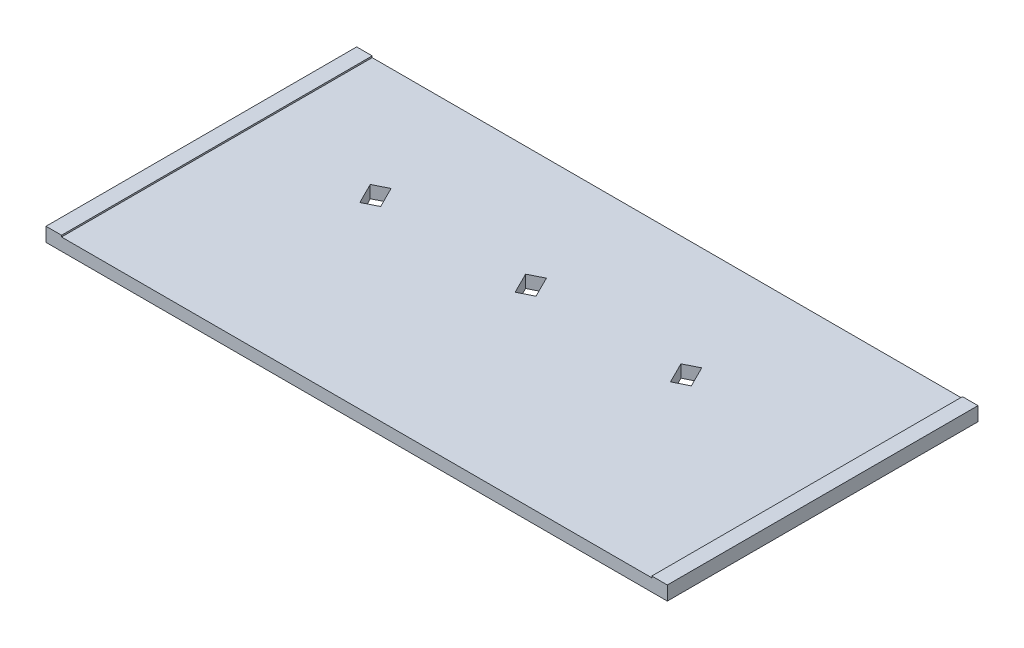
ISO-10303-21;
HEADER;
FILE_DESCRIPTION(('STEP AP214'),'2;1');
FILE_NAME('part.step','',(''),(''),'','','');
FILE_SCHEMA(('AUTOMOTIVE_DESIGN { 1 0 10303 214 1 1 1 1 }'));
ENDSEC;
DATA;
#1=APPLICATION_CONTEXT('core data for automotive mechanical design processes');
#2=APPLICATION_PROTOCOL_DEFINITION('international standard','automotive_design',2000,#1);
#3=PRODUCT_CONTEXT('',#1,'mechanical');
#4=PRODUCT('Part','Part','',(#3));
#5=PRODUCT_RELATED_PRODUCT_CATEGORY('part','',(#4));
#6=PRODUCT_DEFINITION_FORMATION('','',#4);
#7=PRODUCT_DEFINITION_CONTEXT('part definition',#1,'design');
#8=PRODUCT_DEFINITION('design','',#6,#7);
#9=PRODUCT_DEFINITION_SHAPE('','',#8);
#10=(LENGTH_UNIT() NAMED_UNIT(*) SI_UNIT(.MILLI.,.METRE.));
#11=(NAMED_UNIT(*) PLANE_ANGLE_UNIT() SI_UNIT($,.RADIAN.));
#12=(NAMED_UNIT(*) SI_UNIT($,.STERADIAN.) SOLID_ANGLE_UNIT());
#13=UNCERTAINTY_MEASURE_WITH_UNIT(LENGTH_MEASURE(1.E-05),#10,'distance_accuracy_value','');
#14=(GEOMETRIC_REPRESENTATION_CONTEXT(3) GLOBAL_UNCERTAINTY_ASSIGNED_CONTEXT((#13)) GLOBAL_UNIT_ASSIGNED_CONTEXT((#10,
#11,#12)) REPRESENTATION_CONTEXT('',''));
#15=CARTESIAN_POINT('',(0.,0.,0.));
#16=DIRECTION('',(0.,0.,1.));
#17=DIRECTION('',(1.,0.,0.));
#18=AXIS2_PLACEMENT_3D('',#15,#16,#17);
#19=CARTESIAN_POINT('',(0.,2.032,0.));
#20=DIRECTION('',(0.,-1.,0.));
#21=DIRECTION('',(0.,0.,-1.));
#22=AXIS2_PLACEMENT_3D('',#19,#20,#21);
#23=PLANE('',#22);
#24=DIRECTION('',(0.894388560370082,0.,-0.447290848418714));
#25=VECTOR('',#24,1.);
#26=CARTESIAN_POINT('',(-29.3259681459095,2.032,-7.85024109143357));
#27=LINE('',#26,#25);
#28=CARTESIAN_POINT('',(-30.4618416175795,2.032,-7.28218171394181));
#29=VERTEX_POINT('',#28);
#30=CARTESIAN_POINT('',(-28.1900946742395,2.032,-8.41830046892534));
#31=VERTEX_POINT('',#30);
#32=EDGE_CURVE('E276',#29,#31,#27,.T.);
#33=ORIENTED_EDGE('',*,*,#32,.T.);
#34=DIRECTION('',(-0.447290848418715,0.,-0.894388560370081));
#35=VECTOR('',#34,1.);
#36=CARTESIAN_POINT('',(-24.26412652833,2.032,-0.568059377491768));
#37=LINE('',#36,#35);
#38=CARTESIAN_POINT('',(-26.4859165417642,2.032,-5.01068005391533));
#39=VERTEX_POINT('',#38);
#40=EDGE_CURVE('E268',#39,#31,#37,.T.);
#41=ORIENTED_EDGE('',*,*,#40,.F.);
#42=DIRECTION('',(0.894388560370081,0.,-0.447290848418715));
#43=VECTOR('',#42,1.);
#44=CARTESIAN_POINT('',(-27.6217900134342,2.032,-4.44262067642356));
#45=LINE('',#44,#43);
#46=CARTESIAN_POINT('',(-28.7576634851042,2.032,-3.87456129893179));
#47=VERTEX_POINT('',#46);
#48=EDGE_CURVE('E260',#47,#39,#45,.T.);
#49=ORIENTED_EDGE('',*,*,#48,.F.);
#50=DIRECTION('',(-0.447290848418715,0.,-0.894388560370081));
#51=VECTOR('',#50,1.);
#52=CARTESIAN_POINT('',(-26.53587347167,2.032,0.568059377491768));
#53=LINE('',#52,#51);
#54=EDGE_CURVE('E248',#47,#29,#53,.T.);
#55=ORIENTED_EDGE('',*,*,#54,.T.);
#56=EDGE_LOOP('',(#33,#41,#49,#55));
#57=FACE_BOUND('',#56,.T.);
#58=DIRECTION('',(0.894388560370082,0.,-0.447290848418714));
#59=VECTOR('',#58,1.);
#60=CARTESIAN_POINT('',(-3.92596814590948,2.032,-7.85024109143357));
#61=LINE('',#60,#59);
#62=CARTESIAN_POINT('',(-5.06184161757949,2.032,-7.28218171394181));
#63=VERTEX_POINT('',#62);
#64=CARTESIAN_POINT('',(-2.79009467423948,2.032,-8.41830046892534));
#65=VERTEX_POINT('',#64);
#66=EDGE_CURVE('E282',#63,#65,#61,.T.);
#67=ORIENTED_EDGE('',*,*,#66,.T.);
#68=DIRECTION('',(-0.447290848418715,0.,-0.894388560370081));
#69=VECTOR('',#68,1.);
#70=CARTESIAN_POINT('',(1.13587347167,2.032,-0.568059377491768));
#71=LINE('',#70,#69);
#72=CARTESIAN_POINT('',(-1.08591654176418,2.032,-5.01068005391533));
#73=VERTEX_POINT('',#72);
#74=EDGE_CURVE('E317',#73,#65,#71,.T.);
#75=ORIENTED_EDGE('',*,*,#74,.F.);
#76=DIRECTION('',(0.894388560370081,0.,-0.447290848418715));
#77=VECTOR('',#76,1.);
#78=CARTESIAN_POINT('',(-2.22179001343418,2.032,-4.44262067642356));
#79=LINE('',#78,#77);
#80=CARTESIAN_POINT('',(-3.35766348510418,2.032,-3.87456129893179));
#81=VERTEX_POINT('',#80);
#82=EDGE_CURVE('E331',#81,#73,#79,.T.);
#83=ORIENTED_EDGE('',*,*,#82,.F.);
#84=DIRECTION('',(-0.447290848418715,0.,-0.894388560370081));
#85=VECTOR('',#84,1.);
#86=CARTESIAN_POINT('',(-1.13587347167,2.032,0.568059377491768));
#87=LINE('',#86,#85);
#88=EDGE_CURVE('E328',#81,#63,#87,.T.);
#89=ORIENTED_EDGE('',*,*,#88,.T.);
#90=EDGE_LOOP('',(#67,#75,#83,#89));
#91=FACE_BOUND('',#90,.T.);
#92=DIRECTION('',(0.894388560370082,0.,-0.447290848418714));
#93=VECTOR('',#92,1.);
#94=CARTESIAN_POINT('',(21.4740318540905,2.032,-7.85024109143357));
#95=LINE('',#94,#93);
#96=CARTESIAN_POINT('',(20.3381583824205,2.032,-7.28218171394181));
#97=VERTEX_POINT('',#96);
#98=CARTESIAN_POINT('',(22.6099053257605,2.032,-8.41830046892534));
#99=VERTEX_POINT('',#98);
#100=EDGE_CURVE('E309',#97,#99,#95,.T.);
#101=ORIENTED_EDGE('',*,*,#100,.T.);
#102=DIRECTION('',(-0.447290848418715,0.,-0.894388560370081));
#103=VECTOR('',#102,1.);
#104=CARTESIAN_POINT('',(26.53587347167,2.032,-0.568059377491768));
#105=LINE('',#104,#103);
#106=CARTESIAN_POINT('',(24.3140834582358,2.032,-5.01068005391533));
#107=VERTEX_POINT('',#106);
#108=EDGE_CURVE('E301',#107,#99,#105,.T.);
#109=ORIENTED_EDGE('',*,*,#108,.F.);
#110=DIRECTION('',(0.894388560370081,0.,-0.447290848418715));
#111=VECTOR('',#110,1.);
#112=CARTESIAN_POINT('',(23.1782099865658,2.032,-4.44262067642356));
#113=LINE('',#112,#111);
#114=CARTESIAN_POINT('',(22.0423365148958,2.032,-3.87456129893179));
#115=VERTEX_POINT('',#114);
#116=EDGE_CURVE('E293',#115,#107,#113,.T.);
#117=ORIENTED_EDGE('',*,*,#116,.F.);
#118=DIRECTION('',(-0.447290848418715,0.,-0.894388560370081));
#119=VECTOR('',#118,1.);
#120=CARTESIAN_POINT('',(24.26412652833,2.032,0.568059377491768));
#121=LINE('',#120,#119);
#122=EDGE_CURVE('E247',#115,#97,#121,.T.);
#123=ORIENTED_EDGE('',*,*,#122,.T.);
#124=EDGE_LOOP('',(#101,#109,#117,#123));
#125=FACE_BOUND('',#124,.T.);
#126=DIRECTION('',(0.,0.,1.));
#127=VECTOR('',#126,1.);
#128=CARTESIAN_POINT('',(48.26,2.032,0.));
#129=LINE('',#128,#127);
#130=CARTESIAN_POINT('',(48.26,2.032,-25.4));
#131=VERTEX_POINT('',#130);
#132=CARTESIAN_POINT('',(48.26,2.032,25.4));
#133=VERTEX_POINT('',#132);
#134=EDGE_CURVE('E82',#131,#133,#129,.T.);
#135=ORIENTED_EDGE('',*,*,#134,.F.);
#136=DIRECTION('',(-1.,0.,0.));
#137=VECTOR('',#136,1.);
#138=CARTESIAN_POINT('',(-50.8,2.032,-25.4));
#139=LINE('',#138,#137);
#140=CARTESIAN_POINT('',(-48.26,2.032,-25.4));
#141=VERTEX_POINT('',#140);
#142=EDGE_CURVE('E344',#131,#141,#139,.T.);
#143=ORIENTED_EDGE('',*,*,#142,.T.);
#144=DIRECTION('',(0.,0.,1.));
#145=VECTOR('',#144,1.);
#146=CARTESIAN_POINT('',(-48.26,2.032,0.));
#147=LINE('',#146,#145);
#148=CARTESIAN_POINT('',(-48.26,2.032,25.4));
#149=VERTEX_POINT('',#148);
#150=EDGE_CURVE('E225',#141,#149,#147,.T.);
#151=ORIENTED_EDGE('',*,*,#150,.T.);
#152=DIRECTION('',(1.,0.,0.));
#153=VECTOR('',#152,1.);
#154=CARTESIAN_POINT('',(-50.8,2.032,25.4));
#155=LINE('',#154,#153);
#156=EDGE_CURVE('E87',#149,#133,#155,.T.);
#157=ORIENTED_EDGE('',*,*,#156,.T.);
#158=EDGE_LOOP('',(#135,#143,#151,#157));
#159=FACE_BOUND('',#158,.T.);
#160=ADVANCED_FACE('F67',(#57,#91,#125,#159),#23,.F.);
#161=CARTESIAN_POINT('',(0.,0.,0.));
#162=DIRECTION('',(0.,-1.,0.));
#163=DIRECTION('',(0.,0.,-1.));
#164=AXIS2_PLACEMENT_3D('',#161,#162,#163);
#165=PLANE('',#164);
#166=DIRECTION('',(0.,0.,-1.));
#167=VECTOR('',#166,1.);
#168=CARTESIAN_POINT('',(50.8,0.,25.4));
#169=LINE('',#168,#167);
#170=CARTESIAN_POINT('',(50.8,0.,25.4));
#171=VERTEX_POINT('',#170);
#172=CARTESIAN_POINT('',(50.8,0.,-25.4));
#173=VERTEX_POINT('',#172);
#174=EDGE_CURVE('E207',#171,#173,#169,.T.);
#175=ORIENTED_EDGE('',*,*,#174,.F.);
#176=DIRECTION('',(1.,0.,0.));
#177=VECTOR('',#176,1.);
#178=CARTESIAN_POINT('',(-50.8,0.,25.4));
#179=LINE('',#178,#177);
#180=CARTESIAN_POINT('',(-50.8,0.,25.4));
#181=VERTEX_POINT('',#180);
#182=EDGE_CURVE('E346',#181,#171,#179,.T.);
#183=ORIENTED_EDGE('',*,*,#182,.F.);
#184=DIRECTION('',(0.,0.,1.));
#185=VECTOR('',#184,1.);
#186=CARTESIAN_POINT('',(-50.8,0.,25.4));
#187=LINE('',#186,#185);
#188=CARTESIAN_POINT('',(-50.8,0.,-25.4));
#189=VERTEX_POINT('',#188);
#190=EDGE_CURVE('E352',#189,#181,#187,.T.);
#191=ORIENTED_EDGE('',*,*,#190,.F.);
#192=DIRECTION('',(-1.,0.,0.));
#193=VECTOR('',#192,1.);
#194=CARTESIAN_POINT('',(-50.8,0.,-25.4));
#195=LINE('',#194,#193);
#196=EDGE_CURVE('E350',#173,#189,#195,.T.);
#197=ORIENTED_EDGE('',*,*,#196,.F.);
#198=EDGE_LOOP('',(#175,#183,#191,#197));
#199=FACE_BOUND('',#198,.T.);
#200=DIRECTION('',(-0.447290848418715,0.,-0.894388560370081));
#201=VECTOR('',#200,1.);
#202=CARTESIAN_POINT('',(1.13587347167,0.,-0.568059377491768));
#203=LINE('',#202,#201);
#204=CARTESIAN_POINT('',(-1.08591654176418,0.,-5.01068005391533));
#205=VERTEX_POINT('',#204);
#206=CARTESIAN_POINT('',(-2.79009467423948,0.,-8.41830046892534));
#207=VERTEX_POINT('',#206);
#208=EDGE_CURVE('E322',#205,#207,#203,.T.);
#209=ORIENTED_EDGE('',*,*,#208,.T.);
#210=DIRECTION('',(0.894388560370082,0.,-0.447290848418714));
#211=VECTOR('',#210,1.);
#212=CARTESIAN_POINT('',(-3.92596814590948,0.,-7.85024109143357));
#213=LINE('',#212,#211);
#214=CARTESIAN_POINT('',(-5.06184161757949,0.,-7.28218171394181));
#215=VERTEX_POINT('',#214);
#216=EDGE_CURVE('E314',#215,#207,#213,.T.);
#217=ORIENTED_EDGE('',*,*,#216,.F.);
#218=DIRECTION('',(-0.447290848418715,0.,-0.894388560370081));
#219=VECTOR('',#218,1.);
#220=CARTESIAN_POINT('',(-1.13587347167,0.,0.568059377491768));
#221=LINE('',#220,#219);
#222=CARTESIAN_POINT('',(-3.35766348510418,0.,-3.87456129893179));
#223=VERTEX_POINT('',#222);
#224=EDGE_CURVE('E316',#223,#215,#221,.T.);
#225=ORIENTED_EDGE('',*,*,#224,.F.);
#226=DIRECTION('',(0.894388560370081,0.,-0.447290848418715));
#227=VECTOR('',#226,1.);
#228=CARTESIAN_POINT('',(-2.22179001343418,0.,-4.44262067642356));
#229=LINE('',#228,#227);
#230=EDGE_CURVE('E319',#223,#205,#229,.T.);
#231=ORIENTED_EDGE('',*,*,#230,.T.);
#232=EDGE_LOOP('',(#209,#217,#225,#231));
#233=FACE_BOUND('',#232,.T.);
#234=DIRECTION('',(-0.447290848418715,0.,-0.894388560370081));
#235=VECTOR('',#234,1.);
#236=CARTESIAN_POINT('',(26.53587347167,0.,-0.568059377491768));
#237=LINE('',#236,#235);
#238=CARTESIAN_POINT('',(24.3140834582358,0.,-5.01068005391533));
#239=VERTEX_POINT('',#238);
#240=CARTESIAN_POINT('',(22.6099053257605,0.,-8.41830046892534));
#241=VERTEX_POINT('',#240);
#242=EDGE_CURVE('E306',#239,#241,#237,.T.);
#243=ORIENTED_EDGE('',*,*,#242,.T.);
#244=DIRECTION('',(0.894388560370082,0.,-0.447290848418714));
#245=VECTOR('',#244,1.);
#246=CARTESIAN_POINT('',(21.4740318540905,0.,-7.85024109143357));
#247=LINE('',#246,#245);
#248=CARTESIAN_POINT('',(20.3381583824205,0.,-7.28218171394181));
#249=VERTEX_POINT('',#248);
#250=EDGE_CURVE('E252',#249,#241,#247,.T.);
#251=ORIENTED_EDGE('',*,*,#250,.F.);
#252=DIRECTION('',(-0.447290848418715,0.,-0.894388560370081));
#253=VECTOR('',#252,1.);
#254=CARTESIAN_POINT('',(24.26412652833,0.,0.568059377491768));
#255=LINE('',#254,#253);
#256=CARTESIAN_POINT('',(22.0423365148958,0.,-3.87456129893179));
#257=VERTEX_POINT('',#256);
#258=EDGE_CURVE('E285',#257,#249,#255,.T.);
#259=ORIENTED_EDGE('',*,*,#258,.F.);
#260=DIRECTION('',(0.894388560370081,0.,-0.447290848418715));
#261=VECTOR('',#260,1.);
#262=CARTESIAN_POINT('',(23.1782099865658,0.,-4.44262067642356));
#263=LINE('',#262,#261);
#264=EDGE_CURVE('E298',#257,#239,#263,.T.);
#265=ORIENTED_EDGE('',*,*,#264,.T.);
#266=EDGE_LOOP('',(#243,#251,#259,#265));
#267=FACE_BOUND('',#266,.T.);
#268=DIRECTION('',(-0.447290848418715,0.,-0.894388560370081));
#269=VECTOR('',#268,1.);
#270=CARTESIAN_POINT('',(-24.26412652833,0.,-0.568059377491768));
#271=LINE('',#270,#269);
#272=CARTESIAN_POINT('',(-26.4859165417642,0.,-5.01068005391533));
#273=VERTEX_POINT('',#272);
#274=CARTESIAN_POINT('',(-28.1900946742395,0.,-8.41830046892534));
#275=VERTEX_POINT('',#274);
#276=EDGE_CURVE('E273',#273,#275,#271,.T.);
#277=ORIENTED_EDGE('',*,*,#276,.T.);
#278=DIRECTION('',(0.894388560370082,0.,-0.447290848418714));
#279=VECTOR('',#278,1.);
#280=CARTESIAN_POINT('',(-29.3259681459095,0.,-7.85024109143357));
#281=LINE('',#280,#279);
#282=CARTESIAN_POINT('',(-30.4618416175795,0.,-7.28218171394181));
#283=VERTEX_POINT('',#282);
#284=EDGE_CURVE('E279',#283,#275,#281,.T.);
#285=ORIENTED_EDGE('',*,*,#284,.F.);
#286=DIRECTION('',(-0.447290848418715,0.,-0.894388560370081));
#287=VECTOR('',#286,1.);
#288=CARTESIAN_POINT('',(-26.53587347167,0.,0.568059377491768));
#289=LINE('',#288,#287);
#290=CARTESIAN_POINT('',(-28.7576634851042,0.,-3.87456129893179));
#291=VERTEX_POINT('',#290);
#292=EDGE_CURVE('E251',#291,#283,#289,.T.);
#293=ORIENTED_EDGE('',*,*,#292,.F.);
#294=DIRECTION('',(0.894388560370081,0.,-0.447290848418715));
#295=VECTOR('',#294,1.);
#296=CARTESIAN_POINT('',(-27.6217900134342,0.,-4.44262067642356));
#297=LINE('',#296,#295);
#298=EDGE_CURVE('E265',#291,#273,#297,.T.);
#299=ORIENTED_EDGE('',*,*,#298,.T.);
#300=EDGE_LOOP('',(#277,#285,#293,#299));
#301=FACE_BOUND('',#300,.T.);
#302=ADVANCED_FACE('F366',(#199,#233,#267,#301),#165,.T.);
#303=CARTESIAN_POINT('',(50.8,2.032,25.4));
#304=DIRECTION('',(-1.,0.,0.));
#305=DIRECTION('',(0.,0.,1.));
#306=AXIS2_PLACEMENT_3D('',#303,#304,#305);
#307=PLANE('',#306);
#308=ORIENTED_EDGE('',*,*,#174,.T.);
#309=DIRECTION('',(0.,-1.,0.));
#310=VECTOR('',#309,1.);
#311=CARTESIAN_POINT('',(50.8,2.032,-25.4));
#312=LINE('',#311,#310);
#313=CARTESIAN_POINT('',(50.8,2.286,-25.4));
#314=VERTEX_POINT('',#313);
#315=EDGE_CURVE('E12',#314,#173,#312,.T.);
#316=ORIENTED_EDGE('',*,*,#315,.F.);
#317=DIRECTION('',(0.,0.,-1.));
#318=VECTOR('',#317,1.);
#319=CARTESIAN_POINT('',(50.8,2.286,0.));
#320=LINE('',#319,#318);
#321=CARTESIAN_POINT('',(50.8,2.286,25.4));
#322=VERTEX_POINT('',#321);
#323=EDGE_CURVE('E205',#322,#314,#320,.T.);
#324=ORIENTED_EDGE('',*,*,#323,.F.);
#325=DIRECTION('',(0.,-1.,0.));
#326=VECTOR('',#325,1.);
#327=CARTESIAN_POINT('',(50.8,2.032,25.4));
#328=LINE('',#327,#326);
#329=EDGE_CURVE('E348',#322,#171,#328,.T.);
#330=ORIENTED_EDGE('',*,*,#329,.T.);
#331=EDGE_LOOP('',(#308,#316,#324,#330));
#332=FACE_BOUND('',#331,.T.);
#333=ADVANCED_FACE('F69',(#332),#307,.F.);
#334=CARTESIAN_POINT('',(-50.8,2.032,-25.4));
#335=DIRECTION('',(0.,0.,1.));
#336=DIRECTION('',(1.,0.,0.));
#337=AXIS2_PLACEMENT_3D('',#334,#335,#336);
#338=PLANE('',#337);
#339=ORIENTED_EDGE('',*,*,#196,.T.);
#340=DIRECTION('',(0.,-1.,0.));
#341=VECTOR('',#340,1.);
#342=CARTESIAN_POINT('',(-50.8,2.032,-25.4));
#343=LINE('',#342,#341);
#344=CARTESIAN_POINT('',(-50.8,2.286,-25.4));
#345=VERTEX_POINT('',#344);
#346=EDGE_CURVE('E75',#345,#189,#343,.T.);
#347=ORIENTED_EDGE('',*,*,#346,.F.);
#348=DIRECTION('',(-1.,0.,0.));
#349=VECTOR('',#348,1.);
#350=CARTESIAN_POINT('',(0.,2.286,-25.4));
#351=LINE('',#350,#349);
#352=CARTESIAN_POINT('',(-48.26,2.286,-25.4));
#353=VERTEX_POINT('',#352);
#354=EDGE_CURVE('E233',#353,#345,#351,.T.);
#355=ORIENTED_EDGE('',*,*,#354,.F.);
#356=DIRECTION('',(0.,-1.,0.));
#357=VECTOR('',#356,1.);
#358=CARTESIAN_POINT('',(-48.26,2.286,-25.4));
#359=LINE('',#358,#357);
#360=EDGE_CURVE('E244',#353,#141,#359,.T.);
#361=ORIENTED_EDGE('',*,*,#360,.T.);
#362=ORIENTED_EDGE('',*,*,#142,.F.);
#363=DIRECTION('',(0.,-1.,0.));
#364=VECTOR('',#363,1.);
#365=CARTESIAN_POINT('',(48.26,2.286,-25.4));
#366=LINE('',#365,#364);
#367=CARTESIAN_POINT('',(48.26,2.286,-25.4));
#368=VERTEX_POINT('',#367);
#369=EDGE_CURVE('E222',#368,#131,#366,.T.);
#370=ORIENTED_EDGE('',*,*,#369,.F.);
#371=DIRECTION('',(-1.,0.,0.));
#372=VECTOR('',#371,1.);
#373=CARTESIAN_POINT('',(0.,2.286,-25.4));
#374=LINE('',#373,#372);
#375=EDGE_CURVE('E214',#314,#368,#374,.T.);
#376=ORIENTED_EDGE('',*,*,#375,.F.);
#377=ORIENTED_EDGE('',*,*,#315,.T.);
#378=EDGE_LOOP('',(#339,#347,#355,#361,#362,#370,#376,#377));
#379=FACE_BOUND('',#378,.T.);
#380=ADVANCED_FACE('F220',(#379),#338,.F.);
#381=CARTESIAN_POINT('',(-50.8,2.032,25.4));
#382=DIRECTION('',(1.,0.,0.));
#383=DIRECTION('',(0.,0.,-1.));
#384=AXIS2_PLACEMENT_3D('',#381,#382,#383);
#385=PLANE('',#384);
#386=ORIENTED_EDGE('',*,*,#190,.T.);
#387=DIRECTION('',(0.,-1.,0.));
#388=VECTOR('',#387,1.);
#389=CARTESIAN_POINT('',(-50.8,2.032,25.4));
#390=LINE('',#389,#388);
#391=CARTESIAN_POINT('',(-50.8,2.286,25.4));
#392=VERTEX_POINT('',#391);
#393=EDGE_CURVE('E356',#392,#181,#390,.T.);
#394=ORIENTED_EDGE('',*,*,#393,.F.);
#395=DIRECTION('',(0.,0.,1.));
#396=VECTOR('',#395,1.);
#397=CARTESIAN_POINT('',(-50.8,2.286,0.));
#398=LINE('',#397,#396);
#399=EDGE_CURVE('E236',#345,#392,#398,.T.);
#400=ORIENTED_EDGE('',*,*,#399,.F.);
#401=ORIENTED_EDGE('',*,*,#346,.T.);
#402=EDGE_LOOP('',(#386,#394,#400,#401));
#403=FACE_BOUND('',#402,.T.);
#404=ADVANCED_FACE('F362',(#403),#385,.F.);
#405=CARTESIAN_POINT('',(-50.8,2.032,25.4));
#406=DIRECTION('',(0.,0.,-1.));
#407=DIRECTION('',(-1.,0.,0.));
#408=AXIS2_PLACEMENT_3D('',#405,#406,#407);
#409=PLANE('',#408);
#410=ORIENTED_EDGE('',*,*,#182,.T.);
#411=ORIENTED_EDGE('',*,*,#329,.F.);
#412=DIRECTION('',(1.,0.,0.));
#413=VECTOR('',#412,1.);
#414=CARTESIAN_POINT('',(0.,2.286,25.4));
#415=LINE('',#414,#413);
#416=CARTESIAN_POINT('',(48.26,2.286,25.4));
#417=VERTEX_POINT('',#416);
#418=EDGE_CURVE('E217',#417,#322,#415,.T.);
#419=ORIENTED_EDGE('',*,*,#418,.F.);
#420=DIRECTION('',(0.,-1.,0.));
#421=VECTOR('',#420,1.);
#422=CARTESIAN_POINT('',(48.26,2.286,25.4));
#423=LINE('',#422,#421);
#424=EDGE_CURVE('E218',#417,#133,#423,.T.);
#425=ORIENTED_EDGE('',*,*,#424,.T.);
#426=ORIENTED_EDGE('',*,*,#156,.F.);
#427=DIRECTION('',(0.,-1.,0.));
#428=VECTOR('',#427,1.);
#429=CARTESIAN_POINT('',(-48.26,2.286,25.4));
#430=LINE('',#429,#428);
#431=CARTESIAN_POINT('',(-48.26,2.286,25.4));
#432=VERTEX_POINT('',#431);
#433=EDGE_CURVE('E241',#432,#149,#430,.T.);
#434=ORIENTED_EDGE('',*,*,#433,.F.);
#435=DIRECTION('',(1.,0.,0.));
#436=VECTOR('',#435,1.);
#437=CARTESIAN_POINT('',(0.,2.286,25.4));
#438=LINE('',#437,#436);
#439=EDGE_CURVE('E239',#392,#432,#438,.T.);
#440=ORIENTED_EDGE('',*,*,#439,.F.);
#441=ORIENTED_EDGE('',*,*,#393,.T.);
#442=EDGE_LOOP('',(#410,#411,#419,#425,#426,#434,#440,#441));
#443=FACE_BOUND('',#442,.T.);
#444=ADVANCED_FACE('F369',(#443),#409,.F.);
#445=CARTESIAN_POINT('',(-3.92596814590948,0.,-7.85024109143357));
#446=DIRECTION('',(0.447290848418714,0.,0.894388560370081));
#447=DIRECTION('',(0.894388560370081,0.,-0.447290848418714));
#448=AXIS2_PLACEMENT_3D('',#445,#446,#447);
#449=PLANE('',#448);
#450=ORIENTED_EDGE('',*,*,#66,.F.);
#451=DIRECTION('',(0.,1.,0.));
#452=VECTOR('',#451,1.);
#453=CARTESIAN_POINT('',(-5.06184161757949,0.,-7.28218171394181));
#454=LINE('',#453,#452);
#455=EDGE_CURVE('E325',#215,#63,#454,.T.);
#456=ORIENTED_EDGE('',*,*,#455,.F.);
#457=ORIENTED_EDGE('',*,*,#216,.T.);
#458=DIRECTION('',(0.,1.,0.));
#459=VECTOR('',#458,1.);
#460=CARTESIAN_POINT('',(-2.79009467423948,0.,-8.41830046892534));
#461=LINE('',#460,#459);
#462=EDGE_CURVE('E336',#207,#65,#461,.T.);
#463=ORIENTED_EDGE('',*,*,#462,.T.);
#464=EDGE_LOOP('',(#450,#456,#457,#463));
#465=FACE_BOUND('',#464,.T.);
#466=ADVANCED_FACE('F401',(#465),#449,.T.);
#467=CARTESIAN_POINT('',(1.13587347167,0.,-0.568059377491768));
#468=DIRECTION('',(0.894388560370081,0.,-0.447290848418715));
#469=DIRECTION('',(-0.447290848418715,0.,-0.894388560370081));
#470=AXIS2_PLACEMENT_3D('',#467,#468,#469);
#471=PLANE('',#470);
#472=ORIENTED_EDGE('',*,*,#74,.T.);
#473=ORIENTED_EDGE('',*,*,#462,.F.);
#474=ORIENTED_EDGE('',*,*,#208,.F.);
#475=DIRECTION('',(0.,1.,0.));
#476=VECTOR('',#475,1.);
#477=CARTESIAN_POINT('',(-1.08591654176418,0.,-5.01068005391533));
#478=LINE('',#477,#476);
#479=EDGE_CURVE('E338',#205,#73,#478,.T.);
#480=ORIENTED_EDGE('',*,*,#479,.T.);
#481=EDGE_LOOP('',(#472,#473,#474,#480));
#482=FACE_BOUND('',#481,.T.);
#483=ADVANCED_FACE('F627',(#482),#471,.F.);
#484=CARTESIAN_POINT('',(-2.22179001343418,0.,-4.44262067642356));
#485=DIRECTION('',(0.447290848418715,0.,0.894388560370081));
#486=DIRECTION('',(0.894388560370081,0.,-0.447290848418715));
#487=AXIS2_PLACEMENT_3D('',#484,#485,#486);
#488=PLANE('',#487);
#489=ORIENTED_EDGE('',*,*,#82,.T.);
#490=ORIENTED_EDGE('',*,*,#479,.F.);
#491=ORIENTED_EDGE('',*,*,#230,.F.);
#492=DIRECTION('',(0.,1.,0.));
#493=VECTOR('',#492,1.);
#494=CARTESIAN_POINT('',(-3.35766348510418,0.,-3.87456129893179));
#495=LINE('',#494,#493);
#496=EDGE_CURVE('E340',#223,#81,#495,.T.);
#497=ORIENTED_EDGE('',*,*,#496,.T.);
#498=EDGE_LOOP('',(#489,#490,#491,#497));
#499=FACE_BOUND('',#498,.T.);
#500=ADVANCED_FACE('F630',(#499),#488,.F.);
#501=CARTESIAN_POINT('',(-1.13587347167,0.,0.568059377491768));
#502=DIRECTION('',(0.894388560370081,0.,-0.447290848418715));
#503=DIRECTION('',(-0.447290848418715,0.,-0.894388560370081));
#504=AXIS2_PLACEMENT_3D('',#501,#502,#503);
#505=PLANE('',#504);
#506=ORIENTED_EDGE('',*,*,#88,.F.);
#507=ORIENTED_EDGE('',*,*,#496,.F.);
#508=ORIENTED_EDGE('',*,*,#224,.T.);
#509=ORIENTED_EDGE('',*,*,#455,.T.);
#510=EDGE_LOOP('',(#506,#507,#508,#509));
#511=FACE_BOUND('',#510,.T.);
#512=ADVANCED_FACE('F425',(#511),#505,.T.);
#513=CARTESIAN_POINT('',(21.4740318540905,0.,-7.85024109143357));
#514=DIRECTION('',(0.447290848418714,0.,0.894388560370081));
#515=DIRECTION('',(0.894388560370081,0.,-0.447290848418714));
#516=AXIS2_PLACEMENT_3D('',#513,#514,#515);
#517=PLANE('',#516);
#518=ORIENTED_EDGE('',*,*,#100,.F.);
#519=DIRECTION('',(0.,1.,0.));
#520=VECTOR('',#519,1.);
#521=CARTESIAN_POINT('',(20.3381583824205,0.,-7.28218171394181));
#522=LINE('',#521,#520);
#523=EDGE_CURVE('E290',#249,#97,#522,.T.);
#524=ORIENTED_EDGE('',*,*,#523,.F.);
#525=ORIENTED_EDGE('',*,*,#250,.T.);
#526=DIRECTION('',(0.,1.,0.));
#527=VECTOR('',#526,1.);
#528=CARTESIAN_POINT('',(22.6099053257605,0.,-8.41830046892534));
#529=LINE('',#528,#527);
#530=EDGE_CURVE('E303',#241,#99,#529,.T.);
#531=ORIENTED_EDGE('',*,*,#530,.T.);
#532=EDGE_LOOP('',(#518,#524,#525,#531));
#533=FACE_BOUND('',#532,.T.);
#534=ADVANCED_FACE('F430',(#533),#517,.T.);
#535=CARTESIAN_POINT('',(26.53587347167,0.,-0.568059377491768));
#536=DIRECTION('',(0.894388560370081,0.,-0.447290848418715));
#537=DIRECTION('',(-0.447290848418715,0.,-0.894388560370081));
#538=AXIS2_PLACEMENT_3D('',#535,#536,#537);
#539=PLANE('',#538);
#540=ORIENTED_EDGE('',*,*,#108,.T.);
#541=ORIENTED_EDGE('',*,*,#530,.F.);
#542=ORIENTED_EDGE('',*,*,#242,.F.);
#543=DIRECTION('',(0.,1.,0.));
#544=VECTOR('',#543,1.);
#545=CARTESIAN_POINT('',(24.3140834582358,0.,-5.01068005391533));
#546=LINE('',#545,#544);
#547=EDGE_CURVE('E295',#239,#107,#546,.T.);
#548=ORIENTED_EDGE('',*,*,#547,.T.);
#549=EDGE_LOOP('',(#540,#541,#542,#548));
#550=FACE_BOUND('',#549,.T.);
#551=ADVANCED_FACE('F435',(#550),#539,.F.);
#552=CARTESIAN_POINT('',(23.1782099865658,0.,-4.44262067642356));
#553=DIRECTION('',(0.447290848418715,0.,0.894388560370081));
#554=DIRECTION('',(0.894388560370081,0.,-0.447290848418715));
#555=AXIS2_PLACEMENT_3D('',#552,#553,#554);
#556=PLANE('',#555);
#557=ORIENTED_EDGE('',*,*,#116,.T.);
#558=ORIENTED_EDGE('',*,*,#547,.F.);
#559=ORIENTED_EDGE('',*,*,#264,.F.);
#560=DIRECTION('',(0.,1.,0.));
#561=VECTOR('',#560,1.);
#562=CARTESIAN_POINT('',(22.0423365148958,0.,-3.87456129893179));
#563=LINE('',#562,#561);
#564=EDGE_CURVE('E287',#257,#115,#563,.T.);
#565=ORIENTED_EDGE('',*,*,#564,.T.);
#566=EDGE_LOOP('',(#557,#558,#559,#565));
#567=FACE_BOUND('',#566,.T.);
#568=ADVANCED_FACE('F446',(#567),#556,.F.);
#569=CARTESIAN_POINT('',(24.26412652833,0.,0.568059377491768));
#570=DIRECTION('',(0.894388560370081,0.,-0.447290848418715));
#571=DIRECTION('',(-0.447290848418715,0.,-0.894388560370081));
#572=AXIS2_PLACEMENT_3D('',#569,#570,#571);
#573=PLANE('',#572);
#574=ORIENTED_EDGE('',*,*,#122,.F.);
#575=ORIENTED_EDGE('',*,*,#564,.F.);
#576=ORIENTED_EDGE('',*,*,#258,.T.);
#577=ORIENTED_EDGE('',*,*,#523,.T.);
#578=EDGE_LOOP('',(#574,#575,#576,#577));
#579=FACE_BOUND('',#578,.T.);
#580=ADVANCED_FACE('F457',(#579),#573,.T.);
#581=CARTESIAN_POINT('',(-29.3259681459095,0.,-7.85024109143357));
#582=DIRECTION('',(0.447290848418714,0.,0.894388560370081));
#583=DIRECTION('',(0.894388560370081,0.,-0.447290848418714));
#584=AXIS2_PLACEMENT_3D('',#581,#582,#583);
#585=PLANE('',#584);
#586=ORIENTED_EDGE('',*,*,#32,.F.);
#587=DIRECTION('',(0.,1.,0.));
#588=VECTOR('',#587,1.);
#589=CARTESIAN_POINT('',(-30.4618416175795,0.,-7.28218171394181));
#590=LINE('',#589,#588);
#591=EDGE_CURVE('E257',#283,#29,#590,.T.);
#592=ORIENTED_EDGE('',*,*,#591,.F.);
#593=ORIENTED_EDGE('',*,*,#284,.T.);
#594=DIRECTION('',(0.,1.,0.));
#595=VECTOR('',#594,1.);
#596=CARTESIAN_POINT('',(-28.1900946742395,0.,-8.41830046892534));
#597=LINE('',#596,#595);
#598=EDGE_CURVE('E270',#275,#31,#597,.T.);
#599=ORIENTED_EDGE('',*,*,#598,.T.);
#600=EDGE_LOOP('',(#586,#592,#593,#599));
#601=FACE_BOUND('',#600,.T.);
#602=ADVANCED_FACE('F468',(#601),#585,.T.);
#603=CARTESIAN_POINT('',(-24.26412652833,0.,-0.568059377491768));
#604=DIRECTION('',(0.894388560370081,0.,-0.447290848418715));
#605=DIRECTION('',(-0.447290848418715,0.,-0.894388560370081));
#606=AXIS2_PLACEMENT_3D('',#603,#604,#605);
#607=PLANE('',#606);
#608=ORIENTED_EDGE('',*,*,#40,.T.);
#609=ORIENTED_EDGE('',*,*,#598,.F.);
#610=ORIENTED_EDGE('',*,*,#276,.F.);
#611=DIRECTION('',(0.,1.,0.));
#612=VECTOR('',#611,1.);
#613=CARTESIAN_POINT('',(-26.4859165417642,0.,-5.01068005391533));
#614=LINE('',#613,#612);
#615=EDGE_CURVE('E262',#273,#39,#614,.T.);
#616=ORIENTED_EDGE('',*,*,#615,.T.);
#617=EDGE_LOOP('',(#608,#609,#610,#616));
#618=FACE_BOUND('',#617,.T.);
#619=ADVANCED_FACE('F479',(#618),#607,.F.);
#620=CARTESIAN_POINT('',(-27.6217900134342,0.,-4.44262067642356));
#621=DIRECTION('',(0.447290848418715,0.,0.894388560370081));
#622=DIRECTION('',(0.894388560370081,0.,-0.447290848418715));
#623=AXIS2_PLACEMENT_3D('',#620,#621,#622);
#624=PLANE('',#623);
#625=ORIENTED_EDGE('',*,*,#48,.T.);
#626=ORIENTED_EDGE('',*,*,#615,.F.);
#627=ORIENTED_EDGE('',*,*,#298,.F.);
#628=DIRECTION('',(0.,1.,0.));
#629=VECTOR('',#628,1.);
#630=CARTESIAN_POINT('',(-28.7576634851042,0.,-3.87456129893179));
#631=LINE('',#630,#629);
#632=EDGE_CURVE('E254',#291,#47,#631,.T.);
#633=ORIENTED_EDGE('',*,*,#632,.T.);
#634=EDGE_LOOP('',(#625,#626,#627,#633));
#635=FACE_BOUND('',#634,.T.);
#636=ADVANCED_FACE('F489',(#635),#624,.F.);
#637=CARTESIAN_POINT('',(-26.53587347167,0.,0.568059377491768));
#638=DIRECTION('',(0.894388560370081,0.,-0.447290848418715));
#639=DIRECTION('',(-0.447290848418715,0.,-0.894388560370081));
#640=AXIS2_PLACEMENT_3D('',#637,#638,#639);
#641=PLANE('',#640);
#642=ORIENTED_EDGE('',*,*,#54,.F.);
#643=ORIENTED_EDGE('',*,*,#632,.F.);
#644=ORIENTED_EDGE('',*,*,#292,.T.);
#645=ORIENTED_EDGE('',*,*,#591,.T.);
#646=EDGE_LOOP('',(#642,#643,#644,#645));
#647=FACE_BOUND('',#646,.T.);
#648=ADVANCED_FACE('F500',(#647),#641,.T.);
#649=CARTESIAN_POINT('',(-48.26,2.286,0.));
#650=DIRECTION('',(1.,0.,0.));
#651=DIRECTION('',(0.,0.,-1.));
#652=AXIS2_PLACEMENT_3D('',#649,#650,#651);
#653=PLANE('',#652);
#654=ORIENTED_EDGE('',*,*,#150,.F.);
#655=ORIENTED_EDGE('',*,*,#360,.F.);
#656=DIRECTION('',(0.,0.,1.));
#657=VECTOR('',#656,1.);
#658=CARTESIAN_POINT('',(-48.26,2.286,0.));
#659=LINE('',#658,#657);
#660=EDGE_CURVE('E230',#353,#432,#659,.T.);
#661=ORIENTED_EDGE('',*,*,#660,.T.);
#662=ORIENTED_EDGE('',*,*,#433,.T.);
#663=EDGE_LOOP('',(#654,#655,#661,#662));
#664=FACE_BOUND('',#663,.T.);
#665=ADVANCED_FACE('F377',(#664),#653,.T.);
#666=CARTESIAN_POINT('',(0.,2.286,0.));
#667=DIRECTION('',(0.,1.,0.));
#668=DIRECTION('',(0.,0.,1.));
#669=AXIS2_PLACEMENT_3D('',#666,#667,#668);
#670=PLANE('',#669);
#671=ORIENTED_EDGE('',*,*,#660,.F.);
#672=ORIENTED_EDGE('',*,*,#354,.T.);
#673=ORIENTED_EDGE('',*,*,#399,.T.);
#674=ORIENTED_EDGE('',*,*,#439,.T.);
#675=EDGE_LOOP('',(#671,#672,#673,#674));
#676=FACE_BOUND('',#675,.T.);
#677=ADVANCED_FACE('F374',(#676),#670,.T.);
#678=CARTESIAN_POINT('',(48.26,2.286,0.));
#679=DIRECTION('',(1.,0.,0.));
#680=DIRECTION('',(0.,0.,-1.));
#681=AXIS2_PLACEMENT_3D('',#678,#679,#680);
#682=PLANE('',#681);
#683=ORIENTED_EDGE('',*,*,#134,.T.);
#684=ORIENTED_EDGE('',*,*,#424,.F.);
#685=DIRECTION('',(0.,0.,1.));
#686=VECTOR('',#685,1.);
#687=CARTESIAN_POINT('',(48.26,2.286,0.));
#688=LINE('',#687,#686);
#689=EDGE_CURVE('E223',#368,#417,#688,.T.);
#690=ORIENTED_EDGE('',*,*,#689,.F.);
#691=ORIENTED_EDGE('',*,*,#369,.T.);
#692=EDGE_LOOP('',(#683,#684,#690,#691));
#693=FACE_BOUND('',#692,.T.);
#694=ADVANCED_FACE('F383',(#693),#682,.F.);
#695=CARTESIAN_POINT('',(0.,2.286,0.));
#696=DIRECTION('',(0.,1.,0.));
#697=DIRECTION('',(0.,0.,1.));
#698=AXIS2_PLACEMENT_3D('',#695,#696,#697);
#699=PLANE('',#698);
#700=ORIENTED_EDGE('',*,*,#375,.T.);
#701=ORIENTED_EDGE('',*,*,#689,.T.);
#702=ORIENTED_EDGE('',*,*,#418,.T.);
#703=ORIENTED_EDGE('',*,*,#323,.T.);
#704=EDGE_LOOP('',(#700,#701,#702,#703));
#705=FACE_BOUND('',#704,.T.);
#706=ADVANCED_FACE('F213',(#705),#699,.T.);
#707=CLOSED_SHELL('',(#160,#302,#333,#380,#404,#444,#466,#483,#500,#512,#534,#551,#568,#580,
#602,#619,#636,#648,#665,#677,#694,#706));
#708=MANIFOLD_SOLID_BREP('B2',#707);
#709=ADVANCED_BREP_SHAPE_REPRESENTATION('',(#18,#708),#14);
#710=SHAPE_DEFINITION_REPRESENTATION(#9,#709);
ENDSEC;
END-ISO-10303-21;
